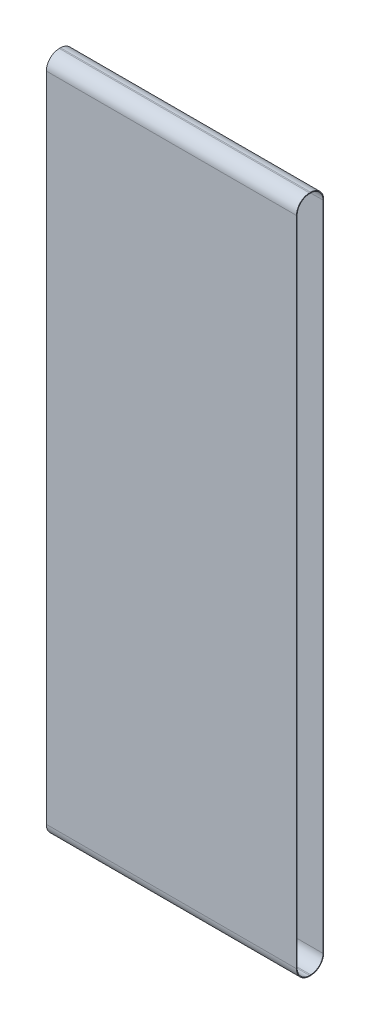
ISO-10303-21;
HEADER;
FILE_DESCRIPTION(('STEP AP214'),'2;1');
FILE_NAME('part.step','',(''),(''),'','','');
FILE_SCHEMA(('AUTOMOTIVE_DESIGN { 1 0 10303 214 1 1 1 1 }'));
ENDSEC;
DATA;
#1=APPLICATION_CONTEXT('core data for automotive mechanical design processes');
#2=APPLICATION_PROTOCOL_DEFINITION('international standard','automotive_design',2000,#1);
#3=PRODUCT_CONTEXT('',#1,'mechanical');
#4=PRODUCT('Part','Part','',(#3));
#5=PRODUCT_RELATED_PRODUCT_CATEGORY('part','',(#4));
#6=PRODUCT_DEFINITION_FORMATION('','',#4);
#7=PRODUCT_DEFINITION_CONTEXT('part definition',#1,'design');
#8=PRODUCT_DEFINITION('design','',#6,#7);
#9=PRODUCT_DEFINITION_SHAPE('','',#8);
#10=(LENGTH_UNIT() NAMED_UNIT(*) SI_UNIT(.MILLI.,.METRE.));
#11=(NAMED_UNIT(*) PLANE_ANGLE_UNIT() SI_UNIT($,.RADIAN.));
#12=(NAMED_UNIT(*) SI_UNIT($,.STERADIAN.) SOLID_ANGLE_UNIT());
#13=UNCERTAINTY_MEASURE_WITH_UNIT(LENGTH_MEASURE(1.E-05),#10,'distance_accuracy_value','');
#14=(GEOMETRIC_REPRESENTATION_CONTEXT(3) GLOBAL_UNCERTAINTY_ASSIGNED_CONTEXT((#13)) GLOBAL_UNIT_ASSIGNED_CONTEXT((#10,
#11,#12)) REPRESENTATION_CONTEXT('',''));
#15=CARTESIAN_POINT('',(0.,0.,0.));
#16=DIRECTION('',(0.,0.,1.));
#17=DIRECTION('',(1.,0.,0.));
#18=AXIS2_PLACEMENT_3D('',#15,#16,#17);
#19=CARTESIAN_POINT('',(-241.3,1308.608,26.289));
#20=DIRECTION('',(1.,0.,0.));
#21=DIRECTION('',(0.,0.,-1.));
#22=AXIS2_PLACEMENT_3D('',#19,#20,#21);
#23=PLANE('',#22);
#24=DIRECTION('',(0.,0.,-1.));
#25=VECTOR('',#24,1.);
#26=CARTESIAN_POINT('',(-241.3,1.34619999999997,1.16839999999996));
#27=LINE('',#26,#25);
#28=CARTESIAN_POINT('',(-241.3,1.34619999999995,1.16839999999997));
#29=VERTEX_POINT('',#28);
#30=CARTESIAN_POINT('',(-241.3,1.3462,-1.16840000000003));
#31=VERTEX_POINT('',#30);
#32=EDGE_CURVE('E156',#29,#31,#27,.T.);
#33=ORIENTED_EDGE('',*,*,#32,.T.);
#34=CARTESIAN_POINT('',(-241.3,25.1205999999999,-1.16840000000003));
#35=DIRECTION('',(1.,0.,0.));
#36=DIRECTION('',(0.,0.,-1.));
#37=AXIS2_PLACEMENT_3D('',#34,#35,#36);
#38=CIRCLE('',#37,23.7744);
#39=CARTESIAN_POINT('',(-241.3,25.1205999999999,-24.9428));
#40=VERTEX_POINT('',#39);
#41=EDGE_CURVE('E150',#31,#40,#38,.T.);
#42=ORIENTED_EDGE('',*,*,#41,.T.);
#43=DIRECTION('',(0.,1.,0.));
#44=VECTOR('',#43,1.);
#45=CARTESIAN_POINT('',(-241.3,25.1205999999999,-24.9428));
#46=LINE('',#45,#44);
#47=CARTESIAN_POINT('',(-241.3,1283.4874,-24.9428));
#48=VERTEX_POINT('',#47);
#49=EDGE_CURVE('E159',#40,#48,#46,.T.);
#50=ORIENTED_EDGE('',*,*,#49,.T.);
#51=CARTESIAN_POINT('',(-241.3,1283.4874,-1.16840000000003));
#52=DIRECTION('',(1.,0.,0.));
#53=DIRECTION('',(0.,0.,-1.));
#54=AXIS2_PLACEMENT_3D('',#51,#52,#53);
#55=CIRCLE('',#54,23.7744);
#56=CARTESIAN_POINT('',(-241.3,1307.2618,-1.16840000000003));
#57=VERTEX_POINT('',#56);
#58=EDGE_CURVE('E51',#48,#57,#55,.T.);
#59=ORIENTED_EDGE('',*,*,#58,.T.);
#60=DIRECTION('',(0.,0.,1.));
#61=VECTOR('',#60,1.);
#62=CARTESIAN_POINT('',(-241.3,1307.2618,-1.16840000000003));
#63=LINE('',#62,#61);
#64=CARTESIAN_POINT('',(-241.3,1307.2618,1.16839999999997));
#65=VERTEX_POINT('',#64);
#66=EDGE_CURVE('E173',#57,#65,#63,.T.);
#67=ORIENTED_EDGE('',*,*,#66,.T.);
#68=CARTESIAN_POINT('',(-241.3,1283.4874,1.16839999999997));
#69=DIRECTION('',(1.,0.,0.));
#70=DIRECTION('',(0.,0.,-1.));
#71=AXIS2_PLACEMENT_3D('',#68,#69,#70);
#72=CIRCLE('',#71,23.7744);
#73=CARTESIAN_POINT('',(-241.3,1283.4874,24.9427999999999));
#74=VERTEX_POINT('',#73);
#75=EDGE_CURVE('E176',#65,#74,#72,.T.);
#76=ORIENTED_EDGE('',*,*,#75,.T.);
#77=DIRECTION('',(0.,-1.,0.));
#78=VECTOR('',#77,1.);
#79=CARTESIAN_POINT('',(-241.3,1283.4874,24.9427999999999));
#80=LINE('',#79,#78);
#81=CARTESIAN_POINT('',(-241.3,25.1205999999999,24.9428));
#82=VERTEX_POINT('',#81);
#83=EDGE_CURVE('E179',#74,#82,#80,.T.);
#84=ORIENTED_EDGE('',*,*,#83,.T.);
#85=CARTESIAN_POINT('',(-241.3,25.1205999999999,1.16839999999997));
#86=DIRECTION('',(1.,0.,0.));
#87=DIRECTION('',(0.,0.,-1.));
#88=AXIS2_PLACEMENT_3D('',#85,#86,#87);
#89=CIRCLE('',#88,23.7744);
#90=EDGE_CURVE('E182',#82,#29,#89,.T.);
#91=ORIENTED_EDGE('',*,*,#90,.T.);
#92=EDGE_LOOP('',(#33,#42,#50,#59,#67,#76,#84,#91));
#93=FACE_BOUND('',#92,.T.);
#94=DIRECTION('',(0.,0.,1.));
#95=VECTOR('',#94,1.);
#96=CARTESIAN_POINT('',(-241.3,1308.608,26.289));
#97=LINE('',#96,#95);
#98=CARTESIAN_POINT('',(-241.3,1308.608,-1.16839999999997));
#99=VERTEX_POINT('',#98);
#100=CARTESIAN_POINT('',(-241.3,1308.608,1.16840000000003));
#101=VERTEX_POINT('',#100);
#102=EDGE_CURVE('E216',#99,#101,#97,.T.);
#103=ORIENTED_EDGE('',*,*,#102,.F.);
#104=CARTESIAN_POINT('',(-241.3,1283.4874,-1.16839999999997));
#105=DIRECTION('',(1.,0.,0.));
#106=DIRECTION('',(0.,0.,-1.));
#107=AXIS2_PLACEMENT_3D('',#104,#105,#106);
#108=CIRCLE('',#107,25.1206);
#109=CARTESIAN_POINT('',(-241.3,1283.4874,-26.289));
#110=VERTEX_POINT('',#109);
#111=EDGE_CURVE('E251',#99,#110,#108,.F.);
#112=ORIENTED_EDGE('',*,*,#111,.T.);
#113=DIRECTION('',(0.,-1.,0.));
#114=VECTOR('',#113,1.);
#115=CARTESIAN_POINT('',(-241.3,1308.608,-26.289));
#116=LINE('',#115,#114);
#117=CARTESIAN_POINT('',(-241.3,25.1205999999999,-26.289));
#118=VERTEX_POINT('',#117);
#119=EDGE_CURVE('E223',#110,#118,#116,.T.);
#120=ORIENTED_EDGE('',*,*,#119,.T.);
#121=CARTESIAN_POINT('',(-241.3,25.1205999999999,-1.16839999999997));
#122=DIRECTION('',(1.,0.,0.));
#123=DIRECTION('',(0.,0.,-1.));
#124=AXIS2_PLACEMENT_3D('',#121,#122,#123);
#125=CIRCLE('',#124,25.1206);
#126=CARTESIAN_POINT('',(-241.3,0.,-1.16839999999997));
#127=VERTEX_POINT('',#126);
#128=EDGE_CURVE('E247',#118,#127,#125,.F.);
#129=ORIENTED_EDGE('',*,*,#128,.T.);
#130=DIRECTION('',(0.,0.,1.));
#131=VECTOR('',#130,1.);
#132=CARTESIAN_POINT('',(-241.3,0.,26.289));
#133=LINE('',#132,#131);
#134=CARTESIAN_POINT('',(-241.3,0.,1.16840000000003));
#135=VERTEX_POINT('',#134);
#136=EDGE_CURVE('E204',#127,#135,#133,.T.);
#137=ORIENTED_EDGE('',*,*,#136,.T.);
#138=CARTESIAN_POINT('',(-241.3,25.1205999999999,1.16840000000003));
#139=DIRECTION('',(1.,0.,0.));
#140=DIRECTION('',(0.,0.,-1.));
#141=AXIS2_PLACEMENT_3D('',#138,#139,#140);
#142=CIRCLE('',#141,25.1206);
#143=CARTESIAN_POINT('',(-241.3,25.1205999999999,26.289));
#144=VERTEX_POINT('',#143);
#145=EDGE_CURVE('E245',#135,#144,#142,.F.);
#146=ORIENTED_EDGE('',*,*,#145,.T.);
#147=DIRECTION('',(0.,-1.,0.));
#148=VECTOR('',#147,1.);
#149=CARTESIAN_POINT('',(-241.3,1308.608,26.289));
#150=LINE('',#149,#148);
#151=CARTESIAN_POINT('',(-241.3,1283.4874,26.289));
#152=VERTEX_POINT('',#151);
#153=EDGE_CURVE('E236',#152,#144,#150,.T.);
#154=ORIENTED_EDGE('',*,*,#153,.F.);
#155=CARTESIAN_POINT('',(-241.3,1283.4874,1.16840000000003));
#156=DIRECTION('',(1.,0.,0.));
#157=DIRECTION('',(0.,0.,-1.));
#158=AXIS2_PLACEMENT_3D('',#155,#156,#157);
#159=CIRCLE('',#158,25.1206);
#160=EDGE_CURVE('E249',#152,#101,#159,.F.);
#161=ORIENTED_EDGE('',*,*,#160,.T.);
#162=EDGE_LOOP('',(#103,#112,#120,#129,#137,#146,#154,#161));
#163=FACE_BOUND('',#162,.T.);
#164=ADVANCED_FACE('F36',(#93,#163),#23,.F.);
#165=CARTESIAN_POINT('',(241.3,1308.608,26.289));
#166=DIRECTION('',(0.,0.,-1.));
#167=DIRECTION('',(-1.,0.,0.));
#168=AXIS2_PLACEMENT_3D('',#165,#166,#167);
#169=PLANE('',#168);
#170=DIRECTION('',(0.,-1.,0.));
#171=VECTOR('',#170,1.);
#172=CARTESIAN_POINT('',(241.3,1308.608,26.289));
#173=LINE('',#172,#171);
#174=CARTESIAN_POINT('',(241.3,1283.4874,26.289));
#175=VERTEX_POINT('',#174);
#176=CARTESIAN_POINT('',(241.3,25.1205999999999,26.289));
#177=VERTEX_POINT('',#176);
#178=EDGE_CURVE('E233',#175,#177,#173,.T.);
#179=ORIENTED_EDGE('',*,*,#178,.F.);
#180=DIRECTION('',(1.,0.,0.));
#181=VECTOR('',#180,1.);
#182=CARTESIAN_POINT('',(-241.3,1283.4874,26.289));
#183=LINE('',#182,#181);
#184=EDGE_CURVE('E269',#175,#152,#183,.F.);
#185=ORIENTED_EDGE('',*,*,#184,.T.);
#186=ORIENTED_EDGE('',*,*,#153,.T.);
#187=DIRECTION('',(1.,0.,0.));
#188=VECTOR('',#187,1.);
#189=CARTESIAN_POINT('',(241.3,25.1205999999999,26.289));
#190=LINE('',#189,#188);
#191=EDGE_CURVE('E266',#144,#177,#190,.T.);
#192=ORIENTED_EDGE('',*,*,#191,.T.);
#193=EDGE_LOOP('',(#179,#185,#186,#192));
#194=FACE_BOUND('',#193,.T.);
#195=ADVANCED_FACE('F283',(#194),#169,.F.);
#196=CARTESIAN_POINT('',(241.3,1308.608,26.289));
#197=DIRECTION('',(-1.,0.,0.));
#198=DIRECTION('',(0.,0.,1.));
#199=AXIS2_PLACEMENT_3D('',#196,#197,#198);
#200=PLANE('',#199);
#201=DIRECTION('',(0.,1.,0.));
#202=VECTOR('',#201,1.);
#203=CARTESIAN_POINT('',(241.3,25.1205999999999,-24.9428));
#204=LINE('',#203,#202);
#205=CARTESIAN_POINT('',(241.3,25.1205999999999,-24.9428));
#206=VERTEX_POINT('',#205);
#207=CARTESIAN_POINT('',(241.3,1283.4874,-24.9428));
#208=VERTEX_POINT('',#207);
#209=EDGE_CURVE('E186',#206,#208,#204,.T.);
#210=ORIENTED_EDGE('',*,*,#209,.F.);
#211=CARTESIAN_POINT('',(241.3,25.1205999999999,-1.16840000000003));
#212=DIRECTION('',(1.,0.,0.));
#213=DIRECTION('',(0.,0.,-1.));
#214=AXIS2_PLACEMENT_3D('',#211,#212,#213);
#215=CIRCLE('',#214,23.7744);
#216=CARTESIAN_POINT('',(241.3,1.3462,-1.16840000000003));
#217=VERTEX_POINT('',#216);
#218=EDGE_CURVE('E59',#217,#206,#215,.T.);
#219=ORIENTED_EDGE('',*,*,#218,.F.);
#220=DIRECTION('',(0.,0.,-1.));
#221=VECTOR('',#220,1.);
#222=CARTESIAN_POINT('',(241.3,1.34619999999997,1.16839999999996));
#223=LINE('',#222,#221);
#224=CARTESIAN_POINT('',(241.3,1.34619999999995,1.16839999999997));
#225=VERTEX_POINT('',#224);
#226=EDGE_CURVE('E166',#225,#217,#223,.T.);
#227=ORIENTED_EDGE('',*,*,#226,.F.);
#228=CARTESIAN_POINT('',(241.3,25.1205999999999,1.16839999999997));
#229=DIRECTION('',(1.,0.,0.));
#230=DIRECTION('',(0.,0.,-1.));
#231=AXIS2_PLACEMENT_3D('',#228,#229,#230);
#232=CIRCLE('',#231,23.7744);
#233=CARTESIAN_POINT('',(241.3,25.1205999999999,24.9428));
#234=VERTEX_POINT('',#233);
#235=EDGE_CURVE('E169',#234,#225,#232,.T.);
#236=ORIENTED_EDGE('',*,*,#235,.F.);
#237=DIRECTION('',(0.,-1.,0.));
#238=VECTOR('',#237,1.);
#239=CARTESIAN_POINT('',(241.3,1283.4874,24.9427999999999));
#240=LINE('',#239,#238);
#241=CARTESIAN_POINT('',(241.3,1283.4874,24.9427999999999));
#242=VERTEX_POINT('',#241);
#243=EDGE_CURVE('E197',#242,#234,#240,.T.);
#244=ORIENTED_EDGE('',*,*,#243,.F.);
#245=CARTESIAN_POINT('',(241.3,1283.4874,1.16839999999997));
#246=DIRECTION('',(1.,0.,0.));
#247=DIRECTION('',(0.,0.,-1.));
#248=AXIS2_PLACEMENT_3D('',#245,#246,#247);
#249=CIRCLE('',#248,23.7744);
#250=CARTESIAN_POINT('',(241.3,1307.2618,1.16839999999997));
#251=VERTEX_POINT('',#250);
#252=EDGE_CURVE('E194',#251,#242,#249,.T.);
#253=ORIENTED_EDGE('',*,*,#252,.F.);
#254=DIRECTION('',(0.,0.,1.));
#255=VECTOR('',#254,1.);
#256=CARTESIAN_POINT('',(241.3,1307.2618,-1.16840000000003));
#257=LINE('',#256,#255);
#258=CARTESIAN_POINT('',(241.3,1307.2618,-1.16840000000003));
#259=VERTEX_POINT('',#258);
#260=EDGE_CURVE('E191',#259,#251,#257,.T.);
#261=ORIENTED_EDGE('',*,*,#260,.F.);
#262=CARTESIAN_POINT('',(241.3,1283.4874,-1.16840000000003));
#263=DIRECTION('',(1.,0.,0.));
#264=DIRECTION('',(0.,0.,-1.));
#265=AXIS2_PLACEMENT_3D('',#262,#263,#264);
#266=CIRCLE('',#265,23.7744);
#267=EDGE_CURVE('E188',#208,#259,#266,.T.);
#268=ORIENTED_EDGE('',*,*,#267,.F.);
#269=EDGE_LOOP('',(#210,#219,#227,#236,#244,#253,#261,#268));
#270=FACE_BOUND('',#269,.T.);
#271=DIRECTION('',(0.,-1.,0.));
#272=VECTOR('',#271,1.);
#273=CARTESIAN_POINT('',(241.3,1308.608,-26.289));
#274=LINE('',#273,#272);
#275=CARTESIAN_POINT('',(241.3,1283.4874,-26.289));
#276=VERTEX_POINT('',#275);
#277=CARTESIAN_POINT('',(241.3,25.1205999999999,-26.289));
#278=VERTEX_POINT('',#277);
#279=EDGE_CURVE('E230',#276,#278,#274,.T.);
#280=ORIENTED_EDGE('',*,*,#279,.F.);
#281=CARTESIAN_POINT('',(241.3,1283.4874,-1.16840000000003));
#282=DIRECTION('',(-1.,0.,0.));
#283=DIRECTION('',(0.,0.,1.));
#284=AXIS2_PLACEMENT_3D('',#281,#282,#283);
#285=CIRCLE('',#284,25.1206);
#286=CARTESIAN_POINT('',(241.3,1308.608,-1.16840000000003));
#287=VERTEX_POINT('',#286);
#288=EDGE_CURVE('E264',#276,#287,#285,.F.);
#289=ORIENTED_EDGE('',*,*,#288,.T.);
#290=DIRECTION('',(0.,0.,-1.));
#291=VECTOR('',#290,1.);
#292=CARTESIAN_POINT('',(241.3,1308.608,26.289));
#293=LINE('',#292,#291);
#294=CARTESIAN_POINT('',(241.3,1308.608,1.16839999999997));
#295=VERTEX_POINT('',#294);
#296=EDGE_CURVE('E219',#295,#287,#293,.T.);
#297=ORIENTED_EDGE('',*,*,#296,.F.);
#298=CARTESIAN_POINT('',(241.3,1283.4874,1.16839999999997));
#299=DIRECTION('',(-1.,0.,0.));
#300=DIRECTION('',(0.,0.,1.));
#301=AXIS2_PLACEMENT_3D('',#298,#299,#300);
#302=CIRCLE('',#301,25.1206);
#303=EDGE_CURVE('E262',#295,#175,#302,.F.);
#304=ORIENTED_EDGE('',*,*,#303,.T.);
#305=ORIENTED_EDGE('',*,*,#178,.T.);
#306=CARTESIAN_POINT('',(241.3,25.1205999999999,1.16839999999997));
#307=DIRECTION('',(-1.,0.,0.));
#308=DIRECTION('',(0.,0.,1.));
#309=AXIS2_PLACEMENT_3D('',#306,#307,#308);
#310=CIRCLE('',#309,25.1206);
#311=CARTESIAN_POINT('',(241.3,0.,1.16839999999997));
#312=VERTEX_POINT('',#311);
#313=EDGE_CURVE('E258',#177,#312,#310,.F.);
#314=ORIENTED_EDGE('',*,*,#313,.T.);
#315=DIRECTION('',(0.,0.,-1.));
#316=VECTOR('',#315,1.);
#317=CARTESIAN_POINT('',(241.3,0.,26.289));
#318=LINE('',#317,#316);
#319=CARTESIAN_POINT('',(241.3,0.,-1.16840000000003));
#320=VERTEX_POINT('',#319);
#321=EDGE_CURVE('E220',#312,#320,#318,.T.);
#322=ORIENTED_EDGE('',*,*,#321,.T.);
#323=CARTESIAN_POINT('',(241.3,25.1205999999999,-1.16840000000003));
#324=DIRECTION('',(-1.,0.,0.));
#325=DIRECTION('',(0.,0.,1.));
#326=AXIS2_PLACEMENT_3D('',#323,#324,#325);
#327=CIRCLE('',#326,25.1206);
#328=EDGE_CURVE('E260',#320,#278,#327,.F.);
#329=ORIENTED_EDGE('',*,*,#328,.T.);
#330=EDGE_LOOP('',(#280,#289,#297,#304,#305,#314,#322,#329));
#331=FACE_BOUND('',#330,.T.);
#332=ADVANCED_FACE('F287',(#270,#331),#200,.F.);
#333=CARTESIAN_POINT('',(241.3,1308.608,-26.289));
#334=DIRECTION('',(0.,0.,1.));
#335=DIRECTION('',(1.,0.,0.));
#336=AXIS2_PLACEMENT_3D('',#333,#334,#335);
#337=PLANE('',#336);
#338=ORIENTED_EDGE('',*,*,#119,.F.);
#339=DIRECTION('',(-1.,0.,0.));
#340=VECTOR('',#339,1.);
#341=CARTESIAN_POINT('',(241.3,1283.4874,-26.289));
#342=LINE('',#341,#340);
#343=EDGE_CURVE('E256',#110,#276,#342,.F.);
#344=ORIENTED_EDGE('',*,*,#343,.T.);
#345=ORIENTED_EDGE('',*,*,#279,.T.);
#346=DIRECTION('',(-1.,0.,0.));
#347=VECTOR('',#346,1.);
#348=CARTESIAN_POINT('',(241.3,25.1205999999999,-26.289));
#349=LINE('',#348,#347);
#350=EDGE_CURVE('E253',#278,#118,#349,.T.);
#351=ORIENTED_EDGE('',*,*,#350,.T.);
#352=EDGE_LOOP('',(#338,#344,#345,#351));
#353=FACE_BOUND('',#352,.T.);
#354=ADVANCED_FACE('F300',(#353),#337,.F.);
#355=CARTESIAN_POINT('',(0.,1308.608,0.));
#356=DIRECTION('',(0.,1.,0.));
#357=DIRECTION('',(0.,0.,1.));
#358=AXIS2_PLACEMENT_3D('',#355,#356,#357);
#359=PLANE('',#358);
#360=ORIENTED_EDGE('',*,*,#296,.T.);
#361=DIRECTION('',(-1.,0.,0.));
#362=VECTOR('',#361,1.);
#363=CARTESIAN_POINT('',(-241.3,1308.608,-1.16839999999997));
#364=LINE('',#363,#362);
#365=EDGE_CURVE('E242',#287,#99,#364,.T.);
#366=ORIENTED_EDGE('',*,*,#365,.T.);
#367=ORIENTED_EDGE('',*,*,#102,.T.);
#368=DIRECTION('',(1.,0.,0.));
#369=VECTOR('',#368,1.);
#370=CARTESIAN_POINT('',(241.3,1308.608,1.16839999999997));
#371=LINE('',#370,#369);
#372=EDGE_CURVE('E239',#101,#295,#371,.T.);
#373=ORIENTED_EDGE('',*,*,#372,.T.);
#374=EDGE_LOOP('',(#360,#366,#367,#373));
#375=FACE_BOUND('',#374,.T.);
#376=ADVANCED_FACE('F294',(#375),#359,.T.);
#377=CARTESIAN_POINT('',(0.,0.,0.));
#378=DIRECTION('',(0.,1.,0.));
#379=DIRECTION('',(0.,0.,1.));
#380=AXIS2_PLACEMENT_3D('',#377,#378,#379);
#381=PLANE('',#380);
#382=ORIENTED_EDGE('',*,*,#136,.F.);
#383=DIRECTION('',(-1.,0.,0.));
#384=VECTOR('',#383,1.);
#385=CARTESIAN_POINT('',(0.,0.,-1.1684));
#386=LINE('',#385,#384);
#387=EDGE_CURVE('E11',#127,#320,#386,.F.);
#388=ORIENTED_EDGE('',*,*,#387,.T.);
#389=ORIENTED_EDGE('',*,*,#321,.F.);
#390=DIRECTION('',(1.,0.,0.));
#391=VECTOR('',#390,1.);
#392=CARTESIAN_POINT('',(0.,0.,1.1684));
#393=LINE('',#392,#391);
#394=EDGE_CURVE('E44',#312,#135,#393,.F.);
#395=ORIENTED_EDGE('',*,*,#394,.T.);
#396=EDGE_LOOP('',(#382,#388,#389,#395));
#397=FACE_BOUND('',#396,.T.);
#398=ADVANCED_FACE('F274',(#397),#381,.F.);
#399=CARTESIAN_POINT('',(0.,1283.4874,-1.1684));
#400=DIRECTION('',(1.,0.,0.));
#401=DIRECTION('',(0.,0.,-1.));
#402=AXIS2_PLACEMENT_3D('',#399,#400,#401);
#403=CYLINDRICAL_SURFACE('',#402,25.1206);
#404=ORIENTED_EDGE('',*,*,#288,.F.);
#405=ORIENTED_EDGE('',*,*,#343,.F.);
#406=ORIENTED_EDGE('',*,*,#111,.F.);
#407=ORIENTED_EDGE('',*,*,#365,.F.);
#408=EDGE_LOOP('',(#404,#405,#406,#407));
#409=FACE_BOUND('',#408,.T.);
#410=ADVANCED_FACE('F303',(#409),#403,.T.);
#411=CARTESIAN_POINT('',(0.,1283.4874,1.1684));
#412=DIRECTION('',(-1.,0.,0.));
#413=DIRECTION('',(0.,0.,1.));
#414=AXIS2_PLACEMENT_3D('',#411,#412,#413);
#415=CYLINDRICAL_SURFACE('',#414,25.1206);
#416=ORIENTED_EDGE('',*,*,#160,.F.);
#417=ORIENTED_EDGE('',*,*,#184,.F.);
#418=ORIENTED_EDGE('',*,*,#303,.F.);
#419=ORIENTED_EDGE('',*,*,#372,.F.);
#420=EDGE_LOOP('',(#416,#417,#418,#419));
#421=FACE_BOUND('',#420,.T.);
#422=ADVANCED_FACE('F292',(#421),#415,.T.);
#423=CARTESIAN_POINT('',(241.3,25.1205999999999,-1.16840000000003));
#424=DIRECTION('',(-1.,0.,0.));
#425=DIRECTION('',(0.,0.,1.));
#426=AXIS2_PLACEMENT_3D('',#423,#424,#425);
#427=CYLINDRICAL_SURFACE('',#426,25.1206);
#428=ORIENTED_EDGE('',*,*,#328,.F.);
#429=ORIENTED_EDGE('',*,*,#387,.F.);
#430=ORIENTED_EDGE('',*,*,#128,.F.);
#431=ORIENTED_EDGE('',*,*,#350,.F.);
#432=EDGE_LOOP('',(#428,#429,#430,#431));
#433=FACE_BOUND('',#432,.T.);
#434=ADVANCED_FACE('F306',(#433),#427,.T.);
#435=CARTESIAN_POINT('',(241.3,25.1205999999999,1.16839999999997));
#436=DIRECTION('',(1.,0.,0.));
#437=DIRECTION('',(0.,0.,-1.));
#438=AXIS2_PLACEMENT_3D('',#435,#436,#437);
#439=CYLINDRICAL_SURFACE('',#438,25.1206);
#440=ORIENTED_EDGE('',*,*,#145,.F.);
#441=ORIENTED_EDGE('',*,*,#394,.F.);
#442=ORIENTED_EDGE('',*,*,#313,.F.);
#443=ORIENTED_EDGE('',*,*,#191,.F.);
#444=EDGE_LOOP('',(#440,#441,#442,#443));
#445=FACE_BOUND('',#444,.T.);
#446=ADVANCED_FACE('F38',(#445),#439,.T.);
#447=CARTESIAN_POINT('',(-241.3,25.1205999999999,-1.16840000000003));
#448=DIRECTION('',(1.,0.,0.));
#449=DIRECTION('',(0.,0.,-1.));
#450=AXIS2_PLACEMENT_3D('',#447,#448,#449);
#451=CYLINDRICAL_SURFACE('',#450,23.7744);
#452=ORIENTED_EDGE('',*,*,#218,.T.);
#453=DIRECTION('',(1.,0.,0.));
#454=VECTOR('',#453,1.);
#455=CARTESIAN_POINT('',(-241.3,25.1205999999999,-24.9428));
#456=LINE('',#455,#454);
#457=EDGE_CURVE('E146',#40,#206,#456,.T.);
#458=ORIENTED_EDGE('',*,*,#457,.F.);
#459=ORIENTED_EDGE('',*,*,#41,.F.);
#460=DIRECTION('',(1.,0.,0.));
#461=VECTOR('',#460,1.);
#462=CARTESIAN_POINT('',(-241.3,1.3462,-1.16840000000003));
#463=LINE('',#462,#461);
#464=EDGE_CURVE('E202',#31,#217,#463,.T.);
#465=ORIENTED_EDGE('',*,*,#464,.T.);
#466=EDGE_LOOP('',(#452,#458,#459,#465));
#467=FACE_BOUND('',#466,.T.);
#468=ADVANCED_FACE('F148',(#467),#451,.F.);
#469=CARTESIAN_POINT('',(-241.3,1.34619999999997,1.16839999999996));
#470=DIRECTION('',(0.,-1.,0.));
#471=DIRECTION('',(0.,0.,-1.));
#472=AXIS2_PLACEMENT_3D('',#469,#470,#471);
#473=PLANE('',#472);
#474=ORIENTED_EDGE('',*,*,#226,.T.);
#475=ORIENTED_EDGE('',*,*,#464,.F.);
#476=ORIENTED_EDGE('',*,*,#32,.F.);
#477=DIRECTION('',(1.,0.,0.));
#478=VECTOR('',#477,1.);
#479=CARTESIAN_POINT('',(-241.3,1.34619999999995,1.16839999999997));
#480=LINE('',#479,#478);
#481=EDGE_CURVE('E205',#29,#225,#480,.T.);
#482=ORIENTED_EDGE('',*,*,#481,.T.);
#483=EDGE_LOOP('',(#474,#475,#476,#482));
#484=FACE_BOUND('',#483,.T.);
#485=ADVANCED_FACE('F357',(#484),#473,.F.);
#486=CARTESIAN_POINT('',(-241.3,25.1205999999999,1.16839999999997));
#487=DIRECTION('',(1.,0.,0.));
#488=DIRECTION('',(0.,0.,-1.));
#489=AXIS2_PLACEMENT_3D('',#486,#487,#488);
#490=CYLINDRICAL_SURFACE('',#489,23.7744);
#491=ORIENTED_EDGE('',*,*,#235,.T.);
#492=ORIENTED_EDGE('',*,*,#481,.F.);
#493=ORIENTED_EDGE('',*,*,#90,.F.);
#494=DIRECTION('',(1.,0.,0.));
#495=VECTOR('',#494,1.);
#496=CARTESIAN_POINT('',(-241.3,25.1205999999999,24.9428));
#497=LINE('',#496,#495);
#498=EDGE_CURVE('E207',#82,#234,#497,.T.);
#499=ORIENTED_EDGE('',*,*,#498,.T.);
#500=EDGE_LOOP('',(#491,#492,#493,#499));
#501=FACE_BOUND('',#500,.T.);
#502=ADVANCED_FACE('F355',(#501),#490,.F.);
#503=CARTESIAN_POINT('',(-241.3,1283.4874,24.9427999999999));
#504=DIRECTION('',(0.,0.,1.));
#505=DIRECTION('',(0.,-1.,0.));
#506=AXIS2_PLACEMENT_3D('',#503,#504,#505);
#507=PLANE('',#506);
#508=ORIENTED_EDGE('',*,*,#243,.T.);
#509=ORIENTED_EDGE('',*,*,#498,.F.);
#510=ORIENTED_EDGE('',*,*,#83,.F.);
#511=DIRECTION('',(1.,0.,0.));
#512=VECTOR('',#511,1.);
#513=CARTESIAN_POINT('',(-241.3,1283.4874,24.9427999999999));
#514=LINE('',#513,#512);
#515=EDGE_CURVE('E209',#74,#242,#514,.T.);
#516=ORIENTED_EDGE('',*,*,#515,.T.);
#517=EDGE_LOOP('',(#508,#509,#510,#516));
#518=FACE_BOUND('',#517,.T.);
#519=ADVANCED_FACE('F351',(#518),#507,.F.);
#520=CARTESIAN_POINT('',(-241.3,1283.4874,1.16839999999997));
#521=DIRECTION('',(1.,0.,0.));
#522=DIRECTION('',(0.,0.,-1.));
#523=AXIS2_PLACEMENT_3D('',#520,#521,#522);
#524=CYLINDRICAL_SURFACE('',#523,23.7744);
#525=ORIENTED_EDGE('',*,*,#252,.T.);
#526=ORIENTED_EDGE('',*,*,#515,.F.);
#527=ORIENTED_EDGE('',*,*,#75,.F.);
#528=DIRECTION('',(1.,0.,0.));
#529=VECTOR('',#528,1.);
#530=CARTESIAN_POINT('',(-241.3,1307.2618,1.16839999999997));
#531=LINE('',#530,#529);
#532=EDGE_CURVE('E211',#65,#251,#531,.T.);
#533=ORIENTED_EDGE('',*,*,#532,.T.);
#534=EDGE_LOOP('',(#525,#526,#527,#533));
#535=FACE_BOUND('',#534,.T.);
#536=ADVANCED_FACE('F348',(#535),#524,.F.);
#537=CARTESIAN_POINT('',(-241.3,1307.2618,-1.16840000000003));
#538=DIRECTION('',(0.,1.,0.));
#539=DIRECTION('',(0.,0.,1.));
#540=AXIS2_PLACEMENT_3D('',#537,#538,#539);
#541=PLANE('',#540);
#542=ORIENTED_EDGE('',*,*,#260,.T.);
#543=ORIENTED_EDGE('',*,*,#532,.F.);
#544=ORIENTED_EDGE('',*,*,#66,.F.);
#545=DIRECTION('',(1.,0.,0.));
#546=VECTOR('',#545,1.);
#547=CARTESIAN_POINT('',(-241.3,1307.2618,-1.16840000000003));
#548=LINE('',#547,#546);
#549=EDGE_CURVE('E213',#57,#259,#548,.T.);
#550=ORIENTED_EDGE('',*,*,#549,.T.);
#551=EDGE_LOOP('',(#542,#543,#544,#550));
#552=FACE_BOUND('',#551,.T.);
#553=ADVANCED_FACE('F344',(#552),#541,.F.);
#554=CARTESIAN_POINT('',(-241.3,1283.4874,-1.16840000000003));
#555=DIRECTION('',(1.,0.,0.));
#556=DIRECTION('',(0.,0.,-1.));
#557=AXIS2_PLACEMENT_3D('',#554,#555,#556);
#558=CYLINDRICAL_SURFACE('',#557,23.7744);
#559=ORIENTED_EDGE('',*,*,#267,.T.);
#560=ORIENTED_EDGE('',*,*,#549,.F.);
#561=ORIENTED_EDGE('',*,*,#58,.F.);
#562=DIRECTION('',(1.,0.,0.));
#563=VECTOR('',#562,1.);
#564=CARTESIAN_POINT('',(-241.3,1283.4874,-24.9428));
#565=LINE('',#564,#563);
#566=EDGE_CURVE('E155',#48,#208,#565,.T.);
#567=ORIENTED_EDGE('',*,*,#566,.T.);
#568=EDGE_LOOP('',(#559,#560,#561,#567));
#569=FACE_BOUND('',#568,.T.);
#570=ADVANCED_FACE('F341',(#569),#558,.F.);
#571=CARTESIAN_POINT('',(-241.3,25.1205999999999,-24.9428));
#572=DIRECTION('',(0.,0.,-1.));
#573=DIRECTION('',(-1.,0.,0.));
#574=AXIS2_PLACEMENT_3D('',#571,#572,#573);
#575=PLANE('',#574);
#576=ORIENTED_EDGE('',*,*,#209,.T.);
#577=ORIENTED_EDGE('',*,*,#566,.F.);
#578=ORIENTED_EDGE('',*,*,#49,.F.);
#579=ORIENTED_EDGE('',*,*,#457,.T.);
#580=EDGE_LOOP('',(#576,#577,#578,#579));
#581=FACE_BOUND('',#580,.T.);
#582=ADVANCED_FACE('F160',(#581),#575,.F.);
#583=CLOSED_SHELL('',(#164,#195,#332,#354,#376,#398,#410,#422,#434,#446,#468,#485,#502,#519,
#536,#553,#570,#582));
#584=MANIFOLD_SOLID_BREP('B2',#583);
#585=ADVANCED_BREP_SHAPE_REPRESENTATION('',(#18,#584),#14);
#586=SHAPE_DEFINITION_REPRESENTATION(#9,#585);
ENDSEC;
END-ISO-10303-21;
